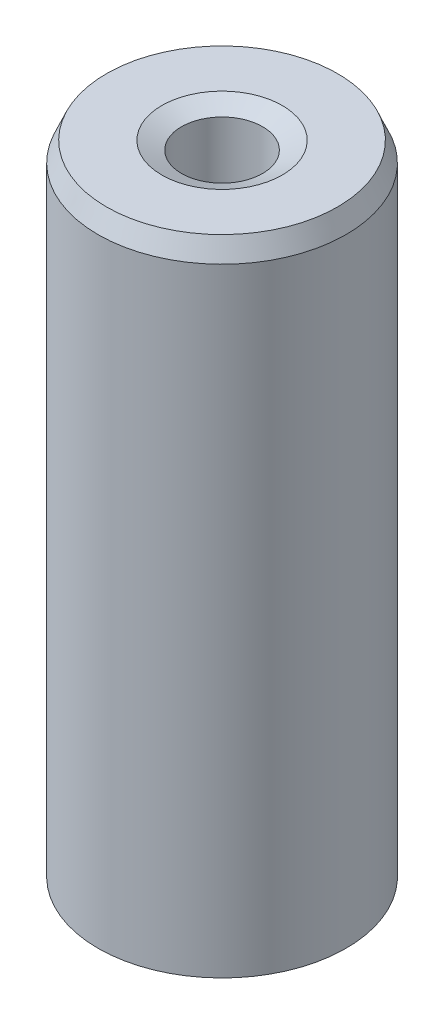
ISO-10303-21;
HEADER;
FILE_DESCRIPTION(('STEP AP214'),'2;1');
FILE_NAME('part.step','',(''),(''),'','','');
FILE_SCHEMA(('AUTOMOTIVE_DESIGN { 1 0 10303 214 1 1 1 1 }'));
ENDSEC;
DATA;
#1=APPLICATION_CONTEXT('core data for automotive mechanical design processes');
#2=APPLICATION_PROTOCOL_DEFINITION('international standard','automotive_design',2000,#1);
#3=PRODUCT_CONTEXT('',#1,'mechanical');
#4=PRODUCT('Part','Part','',(#3));
#5=PRODUCT_RELATED_PRODUCT_CATEGORY('part','',(#4));
#6=PRODUCT_DEFINITION_FORMATION('','',#4);
#7=PRODUCT_DEFINITION_CONTEXT('part definition',#1,'design');
#8=PRODUCT_DEFINITION('design','',#6,#7);
#9=PRODUCT_DEFINITION_SHAPE('','',#8);
#10=(LENGTH_UNIT() NAMED_UNIT(*) SI_UNIT(.MILLI.,.METRE.));
#11=(NAMED_UNIT(*) PLANE_ANGLE_UNIT() SI_UNIT($,.RADIAN.));
#12=(NAMED_UNIT(*) SI_UNIT($,.STERADIAN.) SOLID_ANGLE_UNIT());
#13=UNCERTAINTY_MEASURE_WITH_UNIT(LENGTH_MEASURE(1.E-05),#10,'distance_accuracy_value','');
#14=(GEOMETRIC_REPRESENTATION_CONTEXT(3) GLOBAL_UNCERTAINTY_ASSIGNED_CONTEXT((#13)) GLOBAL_UNIT_ASSIGNED_CONTEXT((#10,
#11,#12)) REPRESENTATION_CONTEXT('',''));
#15=CARTESIAN_POINT('',(0.,0.,0.));
#16=DIRECTION('',(0.,0.,1.));
#17=DIRECTION('',(1.,0.,0.));
#18=AXIS2_PLACEMENT_3D('',#15,#16,#17);
#19=CARTESIAN_POINT('',(0.,26.053671457872,0.));
#20=DIRECTION('',(0.,-1.,0.));
#21=DIRECTION('',(0.,0.,-1.));
#22=AXIS2_PLACEMENT_3D('',#19,#20,#21);
#23=CYLINDRICAL_SURFACE('',#22,5.);
#24=CARTESIAN_POINT('',(0.,0.342458072163872,0.));
#25=DIRECTION('',(0.,1.,0.));
#26=DIRECTION('',(0.,0.,1.));
#27=AXIS2_PLACEMENT_3D('',#24,#25,#26);
#28=CIRCLE('',#27,5.);
#29=CARTESIAN_POINT('',(0.,0.342458072163872,5.));
#30=VERTEX_POINT('',#29);
#31=EDGE_CURVE('E10',#30,#30,#28,.T.);
#32=ORIENTED_EDGE('',*,*,#31,.T.);
#33=EDGE_LOOP('',(#32));
#34=FACE_BOUND('',#33,.T.);
#35=CARTESIAN_POINT('',(0.,25.2601722173471,0.));
#36=DIRECTION('',(0.,1.,0.));
#37=DIRECTION('',(0.,0.,1.));
#38=AXIS2_PLACEMENT_3D('',#35,#36,#37);
#39=CIRCLE('',#38,5.);
#40=CARTESIAN_POINT('',(0.,25.2601722173471,5.));
#41=VERTEX_POINT('',#40);
#42=EDGE_CURVE('E50',#41,#41,#39,.F.);
#43=ORIENTED_EDGE('',*,*,#42,.T.);
#44=EDGE_LOOP('',(#43));
#45=FACE_BOUND('',#44,.T.);
#46=ADVANCED_FACE('F39',(#34,#45),#23,.T.);
#47=CARTESIAN_POINT('',(0.,26.053671457872,0.));
#48=DIRECTION('',(0.,1.,0.));
#49=DIRECTION('',(0.,0.,1.));
#50=AXIS2_PLACEMENT_3D('',#47,#48,#49);
#51=PLANE('',#50);
#52=CARTESIAN_POINT('',(0.,26.053671457872,0.));
#53=DIRECTION('',(0.,1.,0.));
#54=DIRECTION('',(0.,0.,1.));
#55=AXIS2_PLACEMENT_3D('',#52,#53,#54);
#56=CIRCLE('',#55,2.42855580890235);
#57=CARTESIAN_POINT('',(0.,26.053671457872,2.42855580890235));
#58=VERTEX_POINT('',#57);
#59=EDGE_CURVE('E58',#58,#58,#56,.F.);
#60=ORIENTED_EDGE('',*,*,#59,.T.);
#61=EDGE_LOOP('',(#60));
#62=FACE_BOUND('',#61,.T.);
#63=CARTESIAN_POINT('',(0.,26.053671457872,0.));
#64=DIRECTION('',(0.,1.,0.));
#65=DIRECTION('',(0.,0.,1.));
#66=AXIS2_PLACEMENT_3D('',#63,#64,#65);
#67=CIRCLE('',#66,4.65754192783613);
#68=CARTESIAN_POINT('',(0.,26.053671457872,4.65754192783613));
#69=VERTEX_POINT('',#68);
#70=EDGE_CURVE('E61',#69,#69,#67,.T.);
#71=ORIENTED_EDGE('',*,*,#70,.T.);
#72=EDGE_LOOP('',(#71));
#73=FACE_BOUND('',#72,.T.);
#74=ADVANCED_FACE('F88',(#62,#73),#51,.T.);
#75=CARTESIAN_POINT('',(0.,0.,0.));
#76=DIRECTION('',(0.,1.,0.));
#77=DIRECTION('',(0.,0.,1.));
#78=AXIS2_PLACEMENT_3D('',#75,#76,#77);
#79=PLANE('',#78);
#80=CARTESIAN_POINT('',(0.,0.,0.));
#81=DIRECTION('',(0.,1.,0.));
#82=DIRECTION('',(0.,0.,1.));
#83=AXIS2_PLACEMENT_3D('',#80,#81,#82);
#84=CIRCLE('',#83,1.97751464054136);
#85=CARTESIAN_POINT('',(0.,0.,1.97751464054136));
#86=VERTEX_POINT('',#85);
#87=EDGE_CURVE('E51',#86,#86,#84,.T.);
#88=ORIENTED_EDGE('',*,*,#87,.T.);
#89=EDGE_LOOP('',(#88));
#90=FACE_BOUND('',#89,.T.);
#91=CARTESIAN_POINT('',(0.,0.,0.));
#92=DIRECTION('',(0.,1.,0.));
#93=DIRECTION('',(0.,0.,1.));
#94=AXIS2_PLACEMENT_3D('',#91,#92,#93);
#95=CIRCLE('',#94,4.20650075947514);
#96=CARTESIAN_POINT('',(0.,0.,4.20650075947514));
#97=VERTEX_POINT('',#96);
#98=EDGE_CURVE('E54',#97,#97,#95,.F.);
#99=ORIENTED_EDGE('',*,*,#98,.T.);
#100=EDGE_LOOP('',(#99));
#101=FACE_BOUND('',#100,.T.);
#102=ADVANCED_FACE('F83',(#90,#101),#79,.F.);
#103=CARTESIAN_POINT('',(0.,26.053671457872,0.));
#104=DIRECTION('',(0.,-1.,0.));
#105=DIRECTION('',(0.,0.,-1.));
#106=AXIS2_PLACEMENT_3D('',#103,#104,#105);
#107=CYLINDRICAL_SURFACE('',#106,1.63505656837749);
#108=CARTESIAN_POINT('',(0.,25.7112133857081,0.));
#109=DIRECTION('',(0.,1.,0.));
#110=DIRECTION('',(0.,0.,1.));
#111=AXIS2_PLACEMENT_3D('',#108,#109,#110);
#112=CIRCLE('',#111,1.63505656837749);
#113=CARTESIAN_POINT('',(0.,25.7112133857081,1.63505656837749));
#114=VERTEX_POINT('',#113);
#115=EDGE_CURVE('E67',#114,#114,#112,.T.);
#116=ORIENTED_EDGE('',*,*,#115,.T.);
#117=EDGE_LOOP('',(#116));
#118=FACE_BOUND('',#117,.T.);
#119=CARTESIAN_POINT('',(0.,0.79349924052485,0.));
#120=DIRECTION('',(0.,1.,0.));
#121=DIRECTION('',(0.,0.,1.));
#122=AXIS2_PLACEMENT_3D('',#119,#120,#121);
#123=CIRCLE('',#122,1.63505656837749);
#124=CARTESIAN_POINT('',(0.,0.79349924052485,1.63505656837749));
#125=VERTEX_POINT('',#124);
#126=EDGE_CURVE('E69',#125,#125,#123,.F.);
#127=ORIENTED_EDGE('',*,*,#126,.T.);
#128=EDGE_LOOP('',(#127));
#129=FACE_BOUND('',#128,.T.);
#130=ADVANCED_FACE('F71',(#118,#129),#107,.F.);
#131=CARTESIAN_POINT('',(0.,25.7112133857081,0.));
#132=DIRECTION('',(0.,1.,0.));
#133=DIRECTION('',(0.,0.,1.));
#134=AXIS2_PLACEMENT_3D('',#131,#132,#133);
#135=CONICAL_SURFACE('',#134,1.63505656837749,1.16336593818687);
#136=ORIENTED_EDGE('',*,*,#59,.F.);
#137=EDGE_LOOP('',(#136));
#138=FACE_BOUND('',#137,.T.);
#139=ORIENTED_EDGE('',*,*,#115,.F.);
#140=EDGE_LOOP('',(#139));
#141=FACE_BOUND('',#140,.T.);
#142=ADVANCED_FACE('F77',(#138,#141),#135,.F.);
#143=CARTESIAN_POINT('',(0.,0.,0.));
#144=DIRECTION('',(0.,-1.,0.));
#145=DIRECTION('',(0.,0.,-1.));
#146=AXIS2_PLACEMENT_3D('',#143,#144,#145);
#147=CONICAL_SURFACE('',#146,1.97751464054136,0.407430388608028);
#148=ORIENTED_EDGE('',*,*,#126,.F.);
#149=EDGE_LOOP('',(#148));
#150=FACE_BOUND('',#149,.T.);
#151=ORIENTED_EDGE('',*,*,#87,.F.);
#152=EDGE_LOOP('',(#151));
#153=FACE_BOUND('',#152,.T.);
#154=ADVANCED_FACE('F73',(#150,#153),#147,.F.);
#155=CARTESIAN_POINT('',(0.,0.342458072163872,0.));
#156=DIRECTION('',(0.,1.,0.));
#157=DIRECTION('',(0.,0.,1.));
#158=AXIS2_PLACEMENT_3D('',#155,#156,#157);
#159=CONICAL_SURFACE('',#158,5.,1.16336593818687);
#160=ORIENTED_EDGE('',*,*,#98,.F.);
#161=EDGE_LOOP('',(#160));
#162=FACE_BOUND('',#161,.T.);
#163=ORIENTED_EDGE('',*,*,#31,.F.);
#164=EDGE_LOOP('',(#163));
#165=FACE_BOUND('',#164,.T.);
#166=ADVANCED_FACE('F76',(#162,#165),#159,.T.);
#167=CARTESIAN_POINT('',(0.,26.053671457872,0.));
#168=DIRECTION('',(0.,-1.,0.));
#169=DIRECTION('',(0.,0.,-1.));
#170=AXIS2_PLACEMENT_3D('',#167,#168,#169);
#171=CONICAL_SURFACE('',#170,4.65754192783613,0.40743038860803);
#172=ORIENTED_EDGE('',*,*,#42,.F.);
#173=EDGE_LOOP('',(#172));
#174=FACE_BOUND('',#173,.T.);
#175=ORIENTED_EDGE('',*,*,#70,.F.);
#176=EDGE_LOOP('',(#175));
#177=FACE_BOUND('',#176,.T.);
#178=ADVANCED_FACE('F45',(#174,#177),#171,.T.);
#179=CLOSED_SHELL('',(#46,#74,#102,#130,#142,#154,#166,#178));
#180=MANIFOLD_SOLID_BREP('B2',#179);
#181=ADVANCED_BREP_SHAPE_REPRESENTATION('',(#18,#180),#14);
#182=SHAPE_DEFINITION_REPRESENTATION(#9,#181);
ENDSEC;
END-ISO-10303-21;
